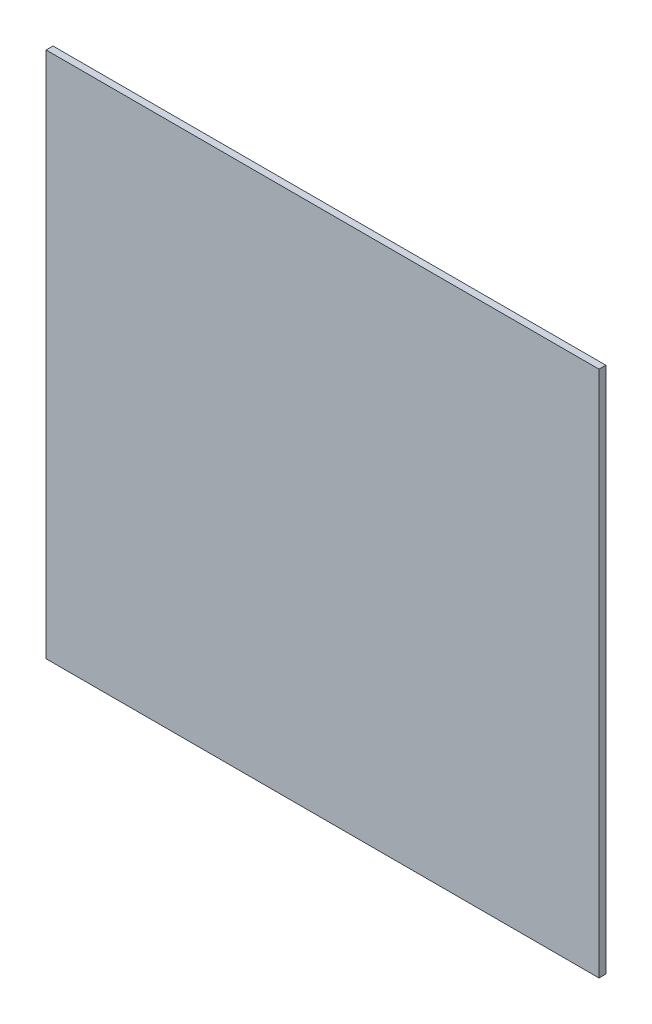
ISO-10303-21;
HEADER;
FILE_DESCRIPTION(('STEP AP214'),'2;1');
FILE_NAME('part.step','',(''),(''),'','','');
FILE_SCHEMA(('AUTOMOTIVE_DESIGN { 1 0 10303 214 1 1 1 1 }'));
ENDSEC;
DATA;
#1=APPLICATION_CONTEXT('core data for automotive mechanical design processes');
#2=APPLICATION_PROTOCOL_DEFINITION('international standard','automotive_design',2000,#1);
#3=PRODUCT_CONTEXT('',#1,'mechanical');
#4=PRODUCT('Part','Part','',(#3));
#5=PRODUCT_RELATED_PRODUCT_CATEGORY('part','',(#4));
#6=PRODUCT_DEFINITION_FORMATION('','',#4);
#7=PRODUCT_DEFINITION_CONTEXT('part definition',#1,'design');
#8=PRODUCT_DEFINITION('design','',#6,#7);
#9=PRODUCT_DEFINITION_SHAPE('','',#8);
#10=(LENGTH_UNIT() NAMED_UNIT(*) SI_UNIT(.MILLI.,.METRE.));
#11=(NAMED_UNIT(*) PLANE_ANGLE_UNIT() SI_UNIT($,.RADIAN.));
#12=(NAMED_UNIT(*) SI_UNIT($,.STERADIAN.) SOLID_ANGLE_UNIT());
#13=UNCERTAINTY_MEASURE_WITH_UNIT(LENGTH_MEASURE(1.E-05),#10,'distance_accuracy_value','');
#14=(GEOMETRIC_REPRESENTATION_CONTEXT(3) GLOBAL_UNCERTAINTY_ASSIGNED_CONTEXT((#13)) GLOBAL_UNIT_ASSIGNED_CONTEXT((#10,
#11,#12)) REPRESENTATION_CONTEXT('',''));
#15=CARTESIAN_POINT('',(0.,0.,0.));
#16=DIRECTION('',(0.,0.,1.));
#17=DIRECTION('',(1.,0.,0.));
#18=AXIS2_PLACEMENT_3D('',#15,#16,#17);
#19=CARTESIAN_POINT('',(479.425,-457.2,11.90625));
#20=DIRECTION('',(-1.,0.,0.));
#21=DIRECTION('',(0.,0.,1.));
#22=AXIS2_PLACEMENT_3D('',#19,#20,#21);
#23=PLANE('',#22);
#24=DIRECTION('',(0.,1.,0.));
#25=VECTOR('',#24,1.);
#26=CARTESIAN_POINT('',(479.425,-457.2,0.));
#27=LINE('',#26,#25);
#28=CARTESIAN_POINT('',(479.425,-457.2,0.));
#29=VERTEX_POINT('',#28);
#30=CARTESIAN_POINT('',(479.425,457.2,0.));
#31=VERTEX_POINT('',#30);
#32=EDGE_CURVE('E95',#29,#31,#27,.T.);
#33=ORIENTED_EDGE('',*,*,#32,.T.);
#34=DIRECTION('',(0.,0.,-1.));
#35=VECTOR('',#34,1.);
#36=CARTESIAN_POINT('',(479.425,457.2,11.90625));
#37=LINE('',#36,#35);
#38=CARTESIAN_POINT('',(479.425,457.2,11.90625));
#39=VERTEX_POINT('',#38);
#40=EDGE_CURVE('E11',#39,#31,#37,.T.);
#41=ORIENTED_EDGE('',*,*,#40,.F.);
#42=DIRECTION('',(0.,1.,0.));
#43=VECTOR('',#42,1.);
#44=CARTESIAN_POINT('',(479.425,-457.2,11.90625));
#45=LINE('',#44,#43);
#46=CARTESIAN_POINT('',(479.425,-457.2,11.90625));
#47=VERTEX_POINT('',#46);
#48=EDGE_CURVE('E83',#47,#39,#45,.T.);
#49=ORIENTED_EDGE('',*,*,#48,.F.);
#50=DIRECTION('',(0.,0.,-1.));
#51=VECTOR('',#50,1.);
#52=CARTESIAN_POINT('',(479.425,-457.2,11.90625));
#53=LINE('',#52,#51);
#54=EDGE_CURVE('E91',#47,#29,#53,.T.);
#55=ORIENTED_EDGE('',*,*,#54,.T.);
#56=EDGE_LOOP('',(#33,#41,#49,#55));
#57=FACE_BOUND('',#56,.T.);
#58=ADVANCED_FACE('F32',(#57),#23,.F.);
#59=CARTESIAN_POINT('',(-479.425,457.2,11.90625));
#60=DIRECTION('',(0.,-1.,0.));
#61=DIRECTION('',(0.,0.,-1.));
#62=AXIS2_PLACEMENT_3D('',#59,#60,#61);
#63=PLANE('',#62);
#64=DIRECTION('',(-1.,0.,0.));
#65=VECTOR('',#64,1.);
#66=CARTESIAN_POINT('',(-479.425,457.2,0.));
#67=LINE('',#66,#65);
#68=CARTESIAN_POINT('',(-479.425,457.2,0.));
#69=VERTEX_POINT('',#68);
#70=EDGE_CURVE('E87',#31,#69,#67,.T.);
#71=ORIENTED_EDGE('',*,*,#70,.T.);
#72=DIRECTION('',(0.,0.,-1.));
#73=VECTOR('',#72,1.);
#74=CARTESIAN_POINT('',(-479.425,457.2,11.90625));
#75=LINE('',#74,#73);
#76=CARTESIAN_POINT('',(-479.425,457.2,11.90625));
#77=VERTEX_POINT('',#76);
#78=EDGE_CURVE('E40',#77,#69,#75,.T.);
#79=ORIENTED_EDGE('',*,*,#78,.F.);
#80=DIRECTION('',(-1.,0.,0.));
#81=VECTOR('',#80,1.);
#82=CARTESIAN_POINT('',(-479.425,457.2,11.90625));
#83=LINE('',#82,#81);
#84=EDGE_CURVE('E78',#39,#77,#83,.T.);
#85=ORIENTED_EDGE('',*,*,#84,.F.);
#86=ORIENTED_EDGE('',*,*,#40,.T.);
#87=EDGE_LOOP('',(#71,#79,#85,#86));
#88=FACE_BOUND('',#87,.T.);
#89=ADVANCED_FACE('F86',(#88),#63,.F.);
#90=CARTESIAN_POINT('',(-479.425,-457.2,11.90625));
#91=DIRECTION('',(1.,0.,0.));
#92=DIRECTION('',(0.,0.,-1.));
#93=AXIS2_PLACEMENT_3D('',#90,#91,#92);
#94=PLANE('',#93);
#95=DIRECTION('',(0.,-1.,0.));
#96=VECTOR('',#95,1.);
#97=CARTESIAN_POINT('',(-479.425,-457.2,0.));
#98=LINE('',#97,#96);
#99=CARTESIAN_POINT('',(-479.425,-457.2,0.));
#100=VERTEX_POINT('',#99);
#101=EDGE_CURVE('E65',#69,#100,#98,.T.);
#102=ORIENTED_EDGE('',*,*,#101,.T.);
#103=DIRECTION('',(0.,0.,-1.));
#104=VECTOR('',#103,1.);
#105=CARTESIAN_POINT('',(-479.425,-457.2,11.90625));
#106=LINE('',#105,#104);
#107=CARTESIAN_POINT('',(-479.425,-457.2,11.90625));
#108=VERTEX_POINT('',#107);
#109=EDGE_CURVE('E88',#108,#100,#106,.T.);
#110=ORIENTED_EDGE('',*,*,#109,.F.);
#111=DIRECTION('',(0.,-1.,0.));
#112=VECTOR('',#111,1.);
#113=CARTESIAN_POINT('',(-479.425,-457.2,11.90625));
#114=LINE('',#113,#112);
#115=EDGE_CURVE('E81',#77,#108,#114,.T.);
#116=ORIENTED_EDGE('',*,*,#115,.F.);
#117=ORIENTED_EDGE('',*,*,#78,.T.);
#118=EDGE_LOOP('',(#102,#110,#116,#117));
#119=FACE_BOUND('',#118,.T.);
#120=ADVANCED_FACE('F89',(#119),#94,.F.);
#121=CARTESIAN_POINT('',(-479.425,-457.2,11.90625));
#122=DIRECTION('',(0.,1.,0.));
#123=DIRECTION('',(0.,0.,1.));
#124=AXIS2_PLACEMENT_3D('',#121,#122,#123);
#125=PLANE('',#124);
#126=DIRECTION('',(1.,0.,0.));
#127=VECTOR('',#126,1.);
#128=CARTESIAN_POINT('',(-479.425,-457.2,0.));
#129=LINE('',#128,#127);
#130=EDGE_CURVE('E71',#100,#29,#129,.T.);
#131=ORIENTED_EDGE('',*,*,#130,.T.);
#132=ORIENTED_EDGE('',*,*,#54,.F.);
#133=DIRECTION('',(1.,0.,0.));
#134=VECTOR('',#133,1.);
#135=CARTESIAN_POINT('',(-479.425,-457.2,11.90625));
#136=LINE('',#135,#134);
#137=EDGE_CURVE('E48',#108,#47,#136,.T.);
#138=ORIENTED_EDGE('',*,*,#137,.F.);
#139=ORIENTED_EDGE('',*,*,#109,.T.);
#140=EDGE_LOOP('',(#131,#132,#138,#139));
#141=FACE_BOUND('',#140,.T.);
#142=ADVANCED_FACE('F102',(#141),#125,.F.);
#143=CARTESIAN_POINT('',(0.,0.,11.90625));
#144=DIRECTION('',(0.,0.,-1.));
#145=DIRECTION('',(-1.,0.,0.));
#146=AXIS2_PLACEMENT_3D('',#143,#144,#145);
#147=PLANE('',#146);
#148=ORIENTED_EDGE('',*,*,#48,.T.);
#149=ORIENTED_EDGE('',*,*,#84,.T.);
#150=ORIENTED_EDGE('',*,*,#115,.T.);
#151=ORIENTED_EDGE('',*,*,#137,.T.);
#152=EDGE_LOOP('',(#148,#149,#150,#151));
#153=FACE_BOUND('',#152,.T.);
#154=ADVANCED_FACE('F79',(#153),#147,.F.);
#155=CARTESIAN_POINT('',(0.,0.,0.));
#156=DIRECTION('',(0.,0.,-1.));
#157=DIRECTION('',(-1.,0.,0.));
#158=AXIS2_PLACEMENT_3D('',#155,#156,#157);
#159=PLANE('',#158);
#160=ORIENTED_EDGE('',*,*,#32,.F.);
#161=ORIENTED_EDGE('',*,*,#130,.F.);
#162=ORIENTED_EDGE('',*,*,#101,.F.);
#163=ORIENTED_EDGE('',*,*,#70,.F.);
#164=EDGE_LOOP('',(#160,#161,#162,#163));
#165=FACE_BOUND('',#164,.T.);
#166=ADVANCED_FACE('F105',(#165),#159,.T.);
#167=CLOSED_SHELL('',(#58,#89,#120,#142,#154,#166));
#168=MANIFOLD_SOLID_BREP('B2',#167);
#169=ADVANCED_BREP_SHAPE_REPRESENTATION('',(#18,#168),#14);
#170=SHAPE_DEFINITION_REPRESENTATION(#9,#169);
ENDSEC;
END-ISO-10303-21;
